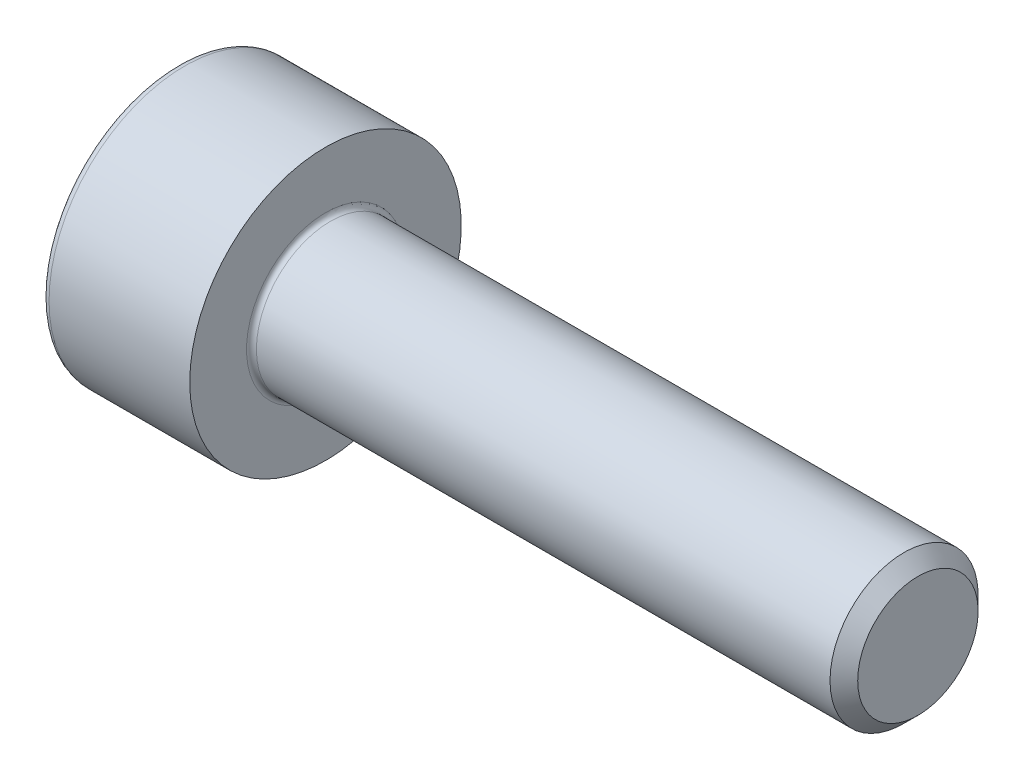
ISO-10303-21;
HEADER;
FILE_DESCRIPTION(('STEP AP214'),'2;1');
FILE_NAME('part.step','',(''),(''),'','','');
FILE_SCHEMA(('AUTOMOTIVE_DESIGN { 1 0 10303 214 1 1 1 1 }'));
ENDSEC;
DATA;
#1=APPLICATION_CONTEXT('core data for automotive mechanical design processes');
#2=APPLICATION_PROTOCOL_DEFINITION('international standard','automotive_design',2000,#1);
#3=PRODUCT_CONTEXT('',#1,'mechanical');
#4=PRODUCT('Part','Part','',(#3));
#5=PRODUCT_RELATED_PRODUCT_CATEGORY('part','',(#4));
#6=PRODUCT_DEFINITION_FORMATION('','',#4);
#7=PRODUCT_DEFINITION_CONTEXT('part definition',#1,'design');
#8=PRODUCT_DEFINITION('design','',#6,#7);
#9=PRODUCT_DEFINITION_SHAPE('','',#8);
#10=(LENGTH_UNIT() NAMED_UNIT(*) SI_UNIT(.MILLI.,.METRE.));
#11=(NAMED_UNIT(*) PLANE_ANGLE_UNIT() SI_UNIT($,.RADIAN.));
#12=(NAMED_UNIT(*) SI_UNIT($,.STERADIAN.) SOLID_ANGLE_UNIT());
#13=UNCERTAINTY_MEASURE_WITH_UNIT(LENGTH_MEASURE(1.E-05),#10,'distance_accuracy_value','');
#14=(GEOMETRIC_REPRESENTATION_CONTEXT(3) GLOBAL_UNCERTAINTY_ASSIGNED_CONTEXT((#13)) GLOBAL_UNIT_ASSIGNED_CONTEXT((#10,
#11,#12)) REPRESENTATION_CONTEXT('',''));
#15=CARTESIAN_POINT('',(0.,0.,0.));
#16=DIRECTION('',(0.,0.,1.));
#17=DIRECTION('',(1.,0.,0.));
#18=AXIS2_PLACEMENT_3D('',#15,#16,#17);
#19=CARTESIAN_POINT('',(0.,0.,0.));
#20=DIRECTION('',(-1.,0.,0.));
#21=DIRECTION('',(0.,0.,1.));
#22=AXIS2_PLACEMENT_3D('',#19,#20,#21);
#23=PLANE('',#22);
#24=DIRECTION('',(0.,-0.499999999999999,0.866025403784439));
#25=VECTOR('',#24,1.);
#26=CARTESIAN_POINT('',(0.,1.47801668912544,0.));
#27=LINE('',#26,#25);
#28=CARTESIAN_POINT('',(0.,1.47801668912544,0.));
#29=VERTEX_POINT('',#28);
#30=CARTESIAN_POINT('',(0.,0.73900834456272,1.28));
#31=VERTEX_POINT('',#30);
#32=EDGE_CURVE('E108',#29,#31,#27,.T.);
#33=ORIENTED_EDGE('',*,*,#32,.T.);
#34=DIRECTION('',(0.,1.,0.));
#35=VECTOR('',#34,1.);
#36=CARTESIAN_POINT('',(0.,-0.739008344562723,1.28));
#37=LINE('',#36,#35);
#38=CARTESIAN_POINT('',(0.,-0.739008344562723,1.28));
#39=VERTEX_POINT('',#38);
#40=EDGE_CURVE('E97',#39,#31,#37,.T.);
#41=ORIENTED_EDGE('',*,*,#40,.F.);
#42=DIRECTION('',(0.,-0.500000000000001,-0.866025403784438));
#43=VECTOR('',#42,1.);
#44=CARTESIAN_POINT('',(0.,-0.739008344562723,1.28));
#45=LINE('',#44,#43);
#46=CARTESIAN_POINT('',(0.,-1.47801668912545,0.));
#47=VERTEX_POINT('',#46);
#48=EDGE_CURVE('E107',#39,#47,#45,.T.);
#49=ORIENTED_EDGE('',*,*,#48,.T.);
#50=DIRECTION('',(0.,0.499999999999999,-0.866025403784439));
#51=VECTOR('',#50,1.);
#52=CARTESIAN_POINT('',(0.,-1.47801668912545,0.));
#53=LINE('',#52,#51);
#54=CARTESIAN_POINT('',(0.,-0.739008344562726,-1.28));
#55=VERTEX_POINT('',#54);
#56=EDGE_CURVE('E126',#47,#55,#53,.T.);
#57=ORIENTED_EDGE('',*,*,#56,.T.);
#58=DIRECTION('',(0.,-1.,0.));
#59=VECTOR('',#58,1.);
#60=CARTESIAN_POINT('',(0.,0.739008344562715,-1.28));
#61=LINE('',#60,#59);
#62=CARTESIAN_POINT('',(0.,0.739008344562715,-1.28));
#63=VERTEX_POINT('',#62);
#64=EDGE_CURVE('E129',#63,#55,#61,.T.);
#65=ORIENTED_EDGE('',*,*,#64,.F.);
#66=DIRECTION('',(0.,-0.500000000000002,-0.866025403784437));
#67=VECTOR('',#66,1.);
#68=CARTESIAN_POINT('',(0.,1.47801668912544,0.));
#69=LINE('',#68,#67);
#70=EDGE_CURVE('E122',#29,#63,#69,.T.);
#71=ORIENTED_EDGE('',*,*,#70,.F.);
#72=EDGE_LOOP('',(#33,#41,#49,#57,#65,#71));
#73=FACE_BOUND('',#72,.T.);
#74=CARTESIAN_POINT('',(0.,0.,0.));
#75=DIRECTION('',(-1.,0.,0.));
#76=DIRECTION('',(0.,0.,1.));
#77=AXIS2_PLACEMENT_3D('',#74,#75,#76);
#78=CIRCLE('',#77,2.6);
#79=CARTESIAN_POINT('',(0.,0.,2.6));
#80=VERTEX_POINT('',#79);
#81=EDGE_CURVE('E33',#80,#80,#78,.T.);
#82=ORIENTED_EDGE('',*,*,#81,.T.);
#83=EDGE_LOOP('',(#82));
#84=FACE_BOUND('',#83,.T.);
#85=ADVANCED_FACE('F26',(#73,#84),#23,.T.);
#86=CARTESIAN_POINT('',(-31.75,0.,0.));
#87=DIRECTION('',(-1.,0.,0.));
#88=DIRECTION('',(0.,0.,1.));
#89=AXIS2_PLACEMENT_3D('',#86,#87,#88);
#90=CYLINDRICAL_SURFACE('',#89,2.75);
#91=CARTESIAN_POINT('',(0.149999999999997,0.,0.));
#92=DIRECTION('',(-1.,0.,0.));
#93=DIRECTION('',(0.,0.,1.));
#94=AXIS2_PLACEMENT_3D('',#91,#92,#93);
#95=CIRCLE('',#94,2.75);
#96=CARTESIAN_POINT('',(0.149999999999997,0.,2.75));
#97=VERTEX_POINT('',#96);
#98=EDGE_CURVE('E11',#97,#97,#95,.F.);
#99=ORIENTED_EDGE('',*,*,#98,.T.);
#100=EDGE_LOOP('',(#99));
#101=FACE_BOUND('',#100,.T.);
#102=CARTESIAN_POINT('',(3.,0.,0.));
#103=DIRECTION('',(-1.,0.,0.));
#104=DIRECTION('',(0.,0.,1.));
#105=AXIS2_PLACEMENT_3D('',#102,#103,#104);
#106=CIRCLE('',#105,2.75);
#107=CARTESIAN_POINT('',(3.,0.,2.75));
#108=VERTEX_POINT('',#107);
#109=EDGE_CURVE('E174',#108,#108,#106,.T.);
#110=ORIENTED_EDGE('',*,*,#109,.T.);
#111=EDGE_LOOP('',(#110));
#112=FACE_BOUND('',#111,.T.);
#113=ADVANCED_FACE('F202',(#101,#112),#90,.T.);
#114=CARTESIAN_POINT('',(3.,2.75,0.));
#115=DIRECTION('',(1.,0.,0.));
#116=DIRECTION('',(0.,0.,-1.));
#117=AXIS2_PLACEMENT_3D('',#114,#115,#116);
#118=PLANE('',#117);
#119=CARTESIAN_POINT('',(3.,0.,0.));
#120=DIRECTION('',(1.,0.,0.));
#121=DIRECTION('',(0.,0.,-1.));
#122=AXIS2_PLACEMENT_3D('',#119,#120,#121);
#123=CIRCLE('',#122,1.6);
#124=CARTESIAN_POINT('',(3.,0.,-1.6));
#125=VERTEX_POINT('',#124);
#126=EDGE_CURVE('E177',#125,#125,#123,.F.);
#127=ORIENTED_EDGE('',*,*,#126,.T.);
#128=EDGE_LOOP('',(#127));
#129=FACE_BOUND('',#128,.T.);
#130=ORIENTED_EDGE('',*,*,#109,.F.);
#131=EDGE_LOOP('',(#130));
#132=FACE_BOUND('',#131,.T.);
#133=ADVANCED_FACE('F205',(#129,#132),#118,.T.);
#134=CARTESIAN_POINT('',(-31.75,0.,0.));
#135=DIRECTION('',(-1.,0.,0.));
#136=DIRECTION('',(0.,0.,1.));
#137=AXIS2_PLACEMENT_3D('',#134,#135,#136);
#138=CYLINDRICAL_SURFACE('',#137,1.5);
#139=CARTESIAN_POINT('',(3.10000000000001,0.,0.));
#140=DIRECTION('',(1.,0.,0.));
#141=DIRECTION('',(0.,0.,-1.));
#142=AXIS2_PLACEMENT_3D('',#139,#140,#141);
#143=CIRCLE('',#142,1.5);
#144=CARTESIAN_POINT('',(3.10000000000001,0.,-1.5));
#145=VERTEX_POINT('',#144);
#146=EDGE_CURVE('E180',#145,#145,#143,.T.);
#147=ORIENTED_EDGE('',*,*,#146,.T.);
#148=EDGE_LOOP('',(#147));
#149=FACE_BOUND('',#148,.T.);
#150=CARTESIAN_POINT('',(14.7195,0.,0.));
#151=DIRECTION('',(-1.,0.,0.));
#152=DIRECTION('',(0.,0.,1.));
#153=AXIS2_PLACEMENT_3D('',#150,#151,#152);
#154=CIRCLE('',#153,1.5);
#155=CARTESIAN_POINT('',(14.7195,0.,1.5));
#156=VERTEX_POINT('',#155);
#157=EDGE_CURVE('E171',#156,#156,#154,.T.);
#158=ORIENTED_EDGE('',*,*,#157,.T.);
#159=EDGE_LOOP('',(#158));
#160=FACE_BOUND('',#159,.T.);
#161=ADVANCED_FACE('F210',(#149,#160),#138,.T.);
#162=CARTESIAN_POINT('',(15.,0.,0.));
#163=DIRECTION('',(-1.,0.,0.));
#164=DIRECTION('',(0.,0.,1.));
#165=AXIS2_PLACEMENT_3D('',#162,#163,#164);
#166=CONICAL_SURFACE('',#165,1.2195,0.785398163397467);
#167=ORIENTED_EDGE('',*,*,#157,.F.);
#168=EDGE_LOOP('',(#167));
#169=FACE_BOUND('',#168,.T.);
#170=CARTESIAN_POINT('',(15.,0.,0.));
#171=DIRECTION('',(-1.,0.,0.));
#172=DIRECTION('',(0.,0.,1.));
#173=AXIS2_PLACEMENT_3D('',#170,#171,#172);
#174=CIRCLE('',#173,1.2195);
#175=CARTESIAN_POINT('',(15.,0.,1.2195));
#176=VERTEX_POINT('',#175);
#177=EDGE_CURVE('E167',#176,#176,#174,.T.);
#178=ORIENTED_EDGE('',*,*,#177,.T.);
#179=EDGE_LOOP('',(#178));
#180=FACE_BOUND('',#179,.T.);
#181=ADVANCED_FACE('F217',(#169,#180),#166,.T.);
#182=CARTESIAN_POINT('',(15.,1.2195,0.));
#183=DIRECTION('',(1.,0.,0.));
#184=DIRECTION('',(0.,0.,-1.));
#185=AXIS2_PLACEMENT_3D('',#182,#183,#184);
#186=PLANE('',#185);
#187=ORIENTED_EDGE('',*,*,#177,.F.);
#188=EDGE_LOOP('',(#187));
#189=FACE_BOUND('',#188,.T.);
#190=ADVANCED_FACE('F197',(#189),#186,.T.);
#191=CARTESIAN_POINT('',(3.10000000000001,0.,0.));
#192=DIRECTION('',(1.,0.,0.));
#193=DIRECTION('',(0.,0.,-1.));
#194=AXIS2_PLACEMENT_3D('',#191,#192,#193);
#195=TOROIDAL_SURFACE('',#194,1.6,0.1);
#196=ORIENTED_EDGE('',*,*,#146,.F.);
#197=EDGE_LOOP('',(#196));
#198=FACE_BOUND('',#197,.T.);
#199=ORIENTED_EDGE('',*,*,#126,.F.);
#200=EDGE_LOOP('',(#199));
#201=FACE_BOUND('',#200,.T.);
#202=ADVANCED_FACE('F187',(#198,#201),#195,.F.);
#203=CARTESIAN_POINT('',(0.149999999999997,0.,0.));
#204=DIRECTION('',(-1.,0.,0.));
#205=DIRECTION('',(0.,0.,1.));
#206=AXIS2_PLACEMENT_3D('',#203,#204,#205);
#207=TOROIDAL_SURFACE('',#206,2.6,0.15);
#208=ORIENTED_EDGE('',*,*,#98,.F.);
#209=EDGE_LOOP('',(#208));
#210=FACE_BOUND('',#209,.T.);
#211=ORIENTED_EDGE('',*,*,#81,.F.);
#212=EDGE_LOOP('',(#211));
#213=FACE_BOUND('',#212,.T.);
#214=ADVANCED_FACE('F185',(#210,#213),#207,.T.);
#215=CARTESIAN_POINT('',(1.3,1.47801668912544,0.));
#216=DIRECTION('',(0.,-0.866025403784439,-0.499999999999999));
#217=DIRECTION('',(0.,0.499999999999999,-0.866025403784439));
#218=AXIS2_PLACEMENT_3D('',#215,#216,#217);
#219=PLANE('',#218);
#220=ORIENTED_EDGE('',*,*,#32,.F.);
#221=DIRECTION('',(-1.,0.,0.));
#222=VECTOR('',#221,1.);
#223=CARTESIAN_POINT('',(1.3,1.47801668912544,0.));
#224=LINE('',#223,#222);
#225=CARTESIAN_POINT('',(1.3,1.47801668912544,0.));
#226=VERTEX_POINT('',#225);
#227=EDGE_CURVE('E152',#226,#29,#224,.T.);
#228=ORIENTED_EDGE('',*,*,#227,.F.);
#229=DIRECTION('',(0.,-0.499999999999999,0.866025403784439));
#230=VECTOR('',#229,1.);
#231=CARTESIAN_POINT('',(1.3,1.47801668912544,0.));
#232=LINE('',#231,#230);
#233=CARTESIAN_POINT('',(1.3,1.10851251684408,0.639999999999997));
#234=VERTEX_POINT('',#233);
#235=EDGE_CURVE('E132',#226,#234,#232,.T.);
#236=ORIENTED_EDGE('',*,*,#235,.T.);
#237=CARTESIAN_POINT('',(1.3,0.73900834456272,1.28));
#238=VERTEX_POINT('',#237);
#239=EDGE_CURVE('E116',#234,#238,#232,.T.);
#240=ORIENTED_EDGE('',*,*,#239,.T.);
#241=DIRECTION('',(-1.,0.,0.));
#242=VECTOR('',#241,1.);
#243=CARTESIAN_POINT('',(1.3,0.73900834456272,1.28));
#244=LINE('',#243,#242);
#245=EDGE_CURVE('E101',#238,#31,#244,.T.);
#246=ORIENTED_EDGE('',*,*,#245,.T.);
#247=EDGE_LOOP('',(#220,#228,#236,#240,#246));
#248=FACE_BOUND('',#247,.T.);
#249=ADVANCED_FACE('F112',(#248),#219,.T.);
#250=CARTESIAN_POINT('',(1.3,-0.739008344562723,1.28));
#251=DIRECTION('',(0.,0.,1.));
#252=DIRECTION('',(0.,-1.,0.));
#253=AXIS2_PLACEMENT_3D('',#250,#251,#252);
#254=PLANE('',#253);
#255=ORIENTED_EDGE('',*,*,#40,.T.);
#256=ORIENTED_EDGE('',*,*,#245,.F.);
#257=DIRECTION('',(0.,1.,0.));
#258=VECTOR('',#257,1.);
#259=CARTESIAN_POINT('',(1.3,-0.739008344562723,1.28));
#260=LINE('',#259,#258);
#261=CARTESIAN_POINT('',(1.3,0.,1.28));
#262=VERTEX_POINT('',#261);
#263=EDGE_CURVE('E134',#262,#238,#260,.T.);
#264=ORIENTED_EDGE('',*,*,#263,.F.);
#265=CARTESIAN_POINT('',(1.3,-0.739008344562723,1.28));
#266=VERTEX_POINT('',#265);
#267=EDGE_CURVE('E135',#266,#262,#260,.T.);
#268=ORIENTED_EDGE('',*,*,#267,.F.);
#269=DIRECTION('',(-1.,0.,0.));
#270=VECTOR('',#269,1.);
#271=CARTESIAN_POINT('',(1.3,-0.739008344562723,1.28));
#272=LINE('',#271,#270);
#273=EDGE_CURVE('E103',#266,#39,#272,.T.);
#274=ORIENTED_EDGE('',*,*,#273,.T.);
#275=EDGE_LOOP('',(#255,#256,#264,#268,#274));
#276=FACE_BOUND('',#275,.T.);
#277=ADVANCED_FACE('F99',(#276),#254,.F.);
#278=CARTESIAN_POINT('',(1.3,-0.739008344562723,1.28));
#279=DIRECTION('',(0.,0.866025403784438,-0.500000000000001));
#280=DIRECTION('',(0.,0.500000000000001,0.866025403784438));
#281=AXIS2_PLACEMENT_3D('',#278,#279,#280);
#282=PLANE('',#281);
#283=ORIENTED_EDGE('',*,*,#48,.F.);
#284=ORIENTED_EDGE('',*,*,#273,.F.);
#285=DIRECTION('',(0.,-0.500000000000001,-0.866025403784438));
#286=VECTOR('',#285,1.);
#287=CARTESIAN_POINT('',(1.3,-0.739008344562723,1.28));
#288=LINE('',#287,#286);
#289=CARTESIAN_POINT('',(1.3,-1.10851251684408,0.640000000000002));
#290=VERTEX_POINT('',#289);
#291=EDGE_CURVE('E139',#266,#290,#288,.T.);
#292=ORIENTED_EDGE('',*,*,#291,.T.);
#293=CARTESIAN_POINT('',(1.3,-1.47801668912545,0.));
#294=VERTEX_POINT('',#293);
#295=EDGE_CURVE('E138',#290,#294,#288,.T.);
#296=ORIENTED_EDGE('',*,*,#295,.T.);
#297=DIRECTION('',(-1.,0.,0.));
#298=VECTOR('',#297,1.);
#299=CARTESIAN_POINT('',(1.3,-1.47801668912545,0.));
#300=LINE('',#299,#298);
#301=EDGE_CURVE('E160',#294,#47,#300,.T.);
#302=ORIENTED_EDGE('',*,*,#301,.T.);
#303=EDGE_LOOP('',(#283,#284,#292,#296,#302));
#304=FACE_BOUND('',#303,.T.);
#305=ADVANCED_FACE('F265',(#304),#282,.T.);
#306=CARTESIAN_POINT('',(1.3,-1.47801668912545,0.));
#307=DIRECTION('',(0.,0.866025403784439,0.499999999999999));
#308=DIRECTION('',(0.,-0.499999999999999,0.866025403784439));
#309=AXIS2_PLACEMENT_3D('',#306,#307,#308);
#310=PLANE('',#309);
#311=ORIENTED_EDGE('',*,*,#56,.F.);
#312=ORIENTED_EDGE('',*,*,#301,.F.);
#313=DIRECTION('',(0.,0.499999999999999,-0.866025403784439));
#314=VECTOR('',#313,1.);
#315=CARTESIAN_POINT('',(1.3,-1.47801668912545,0.));
#316=LINE('',#315,#314);
#317=CARTESIAN_POINT('',(1.3,-1.10851251684409,-0.640000000000002));
#318=VERTEX_POINT('',#317);
#319=EDGE_CURVE('E143',#294,#318,#316,.T.);
#320=ORIENTED_EDGE('',*,*,#319,.T.);
#321=CARTESIAN_POINT('',(1.3,-0.739008344562726,-1.28));
#322=VERTEX_POINT('',#321);
#323=EDGE_CURVE('E142',#318,#322,#316,.T.);
#324=ORIENTED_EDGE('',*,*,#323,.T.);
#325=DIRECTION('',(-1.,0.,0.));
#326=VECTOR('',#325,1.);
#327=CARTESIAN_POINT('',(1.3,-0.739008344562726,-1.28));
#328=LINE('',#327,#326);
#329=EDGE_CURVE('E157',#322,#55,#328,.T.);
#330=ORIENTED_EDGE('',*,*,#329,.T.);
#331=EDGE_LOOP('',(#311,#312,#320,#324,#330));
#332=FACE_BOUND('',#331,.T.);
#333=ADVANCED_FACE('F272',(#332),#310,.T.);
#334=CARTESIAN_POINT('',(1.3,0.739008344562715,-1.28));
#335=DIRECTION('',(0.,0.,-1.));
#336=DIRECTION('',(0.,1.,0.));
#337=AXIS2_PLACEMENT_3D('',#334,#335,#336);
#338=PLANE('',#337);
#339=ORIENTED_EDGE('',*,*,#64,.T.);
#340=ORIENTED_EDGE('',*,*,#329,.F.);
#341=DIRECTION('',(0.,-1.,0.));
#342=VECTOR('',#341,1.);
#343=CARTESIAN_POINT('',(1.3,0.739008344562715,-1.28));
#344=LINE('',#343,#342);
#345=CARTESIAN_POINT('',(1.3,0.,-1.28));
#346=VERTEX_POINT('',#345);
#347=EDGE_CURVE('E146',#346,#322,#344,.T.);
#348=ORIENTED_EDGE('',*,*,#347,.F.);
#349=CARTESIAN_POINT('',(1.3,0.739008344562715,-1.28));
#350=VERTEX_POINT('',#349);
#351=EDGE_CURVE('E40',#350,#346,#344,.T.);
#352=ORIENTED_EDGE('',*,*,#351,.F.);
#353=DIRECTION('',(-1.,0.,0.));
#354=VECTOR('',#353,1.);
#355=CARTESIAN_POINT('',(1.3,0.739008344562715,-1.28));
#356=LINE('',#355,#354);
#357=EDGE_CURVE('E154',#350,#63,#356,.T.);
#358=ORIENTED_EDGE('',*,*,#357,.T.);
#359=EDGE_LOOP('',(#339,#340,#348,#352,#358));
#360=FACE_BOUND('',#359,.T.);
#361=ADVANCED_FACE('F280',(#360),#338,.F.);
#362=CARTESIAN_POINT('',(1.3,1.47801668912544,0.));
#363=DIRECTION('',(0.,0.866025403784437,-0.500000000000002));
#364=DIRECTION('',(0.,0.500000000000002,0.866025403784437));
#365=AXIS2_PLACEMENT_3D('',#362,#363,#364);
#366=PLANE('',#365);
#367=ORIENTED_EDGE('',*,*,#70,.T.);
#368=ORIENTED_EDGE('',*,*,#357,.F.);
#369=DIRECTION('',(0.,-0.500000000000002,-0.866025403784437));
#370=VECTOR('',#369,1.);
#371=CARTESIAN_POINT('',(1.3,1.47801668912544,0.));
#372=LINE('',#371,#370);
#373=CARTESIAN_POINT('',(1.3,1.10851251684408,-0.640000000000002));
#374=VERTEX_POINT('',#373);
#375=EDGE_CURVE('E148',#374,#350,#372,.T.);
#376=ORIENTED_EDGE('',*,*,#375,.F.);
#377=EDGE_CURVE('E149',#226,#374,#372,.T.);
#378=ORIENTED_EDGE('',*,*,#377,.F.);
#379=ORIENTED_EDGE('',*,*,#227,.T.);
#380=EDGE_LOOP('',(#367,#368,#376,#378,#379));
#381=FACE_BOUND('',#380,.T.);
#382=ADVANCED_FACE('F288',(#381),#366,.F.);
#383=CARTESIAN_POINT('',(1.3,1.47801668912544,0.));
#384=DIRECTION('',(1.,0.,0.));
#385=DIRECTION('',(0.,0.,-1.));
#386=AXIS2_PLACEMENT_3D('',#383,#384,#385);
#387=PLANE('',#386);
#388=ORIENTED_EDGE('',*,*,#347,.T.);
#389=ORIENTED_EDGE('',*,*,#323,.F.);
#390=CARTESIAN_POINT('',(1.3,0.,0.));
#391=DIRECTION('',(-1.,0.,0.));
#392=DIRECTION('',(0.,0.,1.));
#393=AXIS2_PLACEMENT_3D('',#390,#391,#392);
#394=CIRCLE('',#393,1.28);
#395=EDGE_CURVE('E348',#346,#318,#394,.T.);
#396=ORIENTED_EDGE('',*,*,#395,.F.);
#397=EDGE_LOOP('',(#388,#389,#396));
#398=FACE_BOUND('',#397,.T.);
#399=ADVANCED_FACE('F296',(#398),#387,.F.);
#400=ORIENTED_EDGE('',*,*,#319,.F.);
#401=ORIENTED_EDGE('',*,*,#295,.F.);
#402=EDGE_CURVE('E351',#318,#290,#394,.T.);
#403=ORIENTED_EDGE('',*,*,#402,.F.);
#404=EDGE_LOOP('',(#400,#401,#403));
#405=FACE_BOUND('',#404,.T.);
#406=ADVANCED_FACE('F304',(#405),#387,.F.);
#407=ORIENTED_EDGE('',*,*,#291,.F.);
#408=ORIENTED_EDGE('',*,*,#267,.T.);
#409=EDGE_CURVE('E117',#290,#262,#394,.T.);
#410=ORIENTED_EDGE('',*,*,#409,.F.);
#411=EDGE_LOOP('',(#407,#408,#410));
#412=FACE_BOUND('',#411,.T.);
#413=ADVANCED_FACE('F312',(#412),#387,.F.);
#414=ORIENTED_EDGE('',*,*,#263,.T.);
#415=ORIENTED_EDGE('',*,*,#239,.F.);
#416=EDGE_CURVE('E164',#262,#234,#394,.T.);
#417=ORIENTED_EDGE('',*,*,#416,.F.);
#418=EDGE_LOOP('',(#414,#415,#417));
#419=FACE_BOUND('',#418,.T.);
#420=ADVANCED_FACE('F319',(#419),#387,.F.);
#421=ORIENTED_EDGE('',*,*,#235,.F.);
#422=ORIENTED_EDGE('',*,*,#377,.T.);
#423=EDGE_CURVE('E168',#234,#374,#394,.T.);
#424=ORIENTED_EDGE('',*,*,#423,.F.);
#425=EDGE_LOOP('',(#421,#422,#424));
#426=FACE_BOUND('',#425,.T.);
#427=ADVANCED_FACE('F326',(#426),#387,.F.);
#428=ORIENTED_EDGE('',*,*,#375,.T.);
#429=ORIENTED_EDGE('',*,*,#351,.T.);
#430=EDGE_CURVE('E341',#374,#346,#394,.T.);
#431=ORIENTED_EDGE('',*,*,#430,.F.);
#432=EDGE_LOOP('',(#428,#429,#431));
#433=FACE_BOUND('',#432,.T.);
#434=ADVANCED_FACE('F251',(#433),#387,.F.);
#435=CARTESIAN_POINT('',(1.3,0.,0.));
#436=DIRECTION('',(-1.,0.,0.));
#437=DIRECTION('',(0.,0.,1.));
#438=AXIS2_PLACEMENT_3D('',#435,#436,#437);
#439=CONICAL_SURFACE('',#438,1.28,1.04719755119659);
#440=CARTESIAN_POINT('',(2.03900834456273,0.,0.));
#441=VERTEX_POINT('',#440);
#442=VERTEX_LOOP('',#441);
#443=FACE_BOUND('',#442,.T.);
#444=ORIENTED_EDGE('',*,*,#416,.T.);
#445=ORIENTED_EDGE('',*,*,#423,.T.);
#446=ORIENTED_EDGE('',*,*,#430,.T.);
#447=ORIENTED_EDGE('',*,*,#395,.T.);
#448=ORIENTED_EDGE('',*,*,#402,.T.);
#449=ORIENTED_EDGE('',*,*,#409,.T.);
#450=EDGE_LOOP('',(#444,#445,#446,#447,#448,#449));
#451=FACE_BOUND('',#450,.T.);
#452=ADVANCED_FACE('F247',(#443,#451),#439,.F.);
#453=CLOSED_SHELL('',(#85,#113,#133,#161,#181,#190,#202,#214,#249,#277,#305,#333,#361,#382,#399,
#406,#413,#420,#427,#434,#452));
#454=MANIFOLD_SOLID_BREP('B2',#453);
#455=ADVANCED_BREP_SHAPE_REPRESENTATION('',(#18,#454),#14);
#456=SHAPE_DEFINITION_REPRESENTATION(#9,#455);
ENDSEC;
END-ISO-10303-21;
